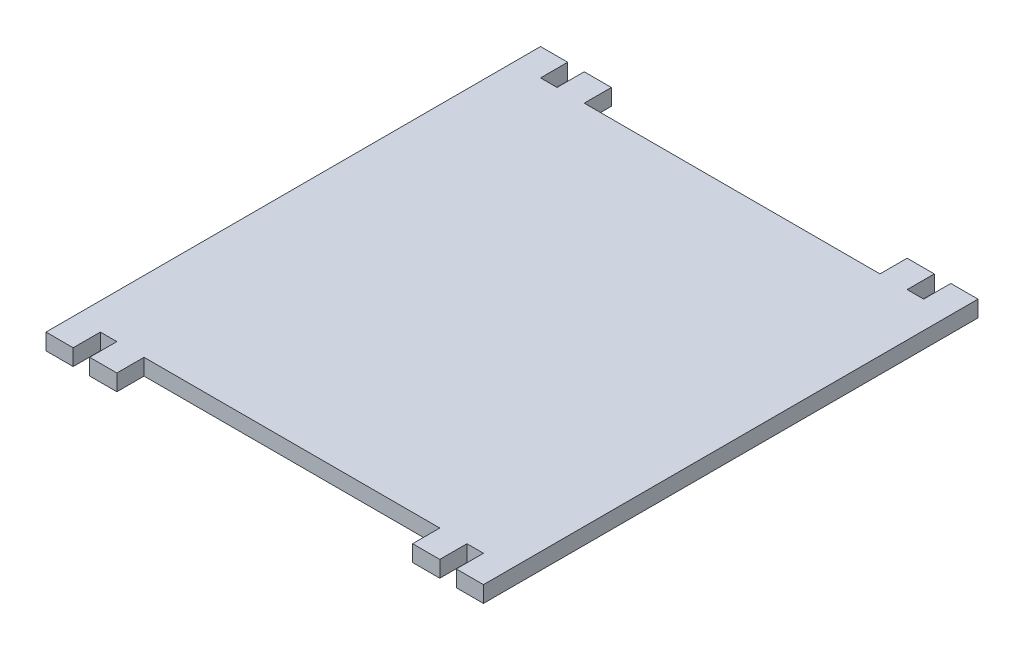
ISO-10303-21;
HEADER;
FILE_DESCRIPTION(('STEP AP214'),'2;1');
FILE_NAME('part.step','',(''),(''),'','','');
FILE_SCHEMA(('AUTOMOTIVE_DESIGN { 1 0 10303 214 1 1 1 1 }'));
ENDSEC;
DATA;
#1=APPLICATION_CONTEXT('core data for automotive mechanical design processes');
#2=APPLICATION_PROTOCOL_DEFINITION('international standard','automotive_design',2000,#1);
#3=PRODUCT_CONTEXT('',#1,'mechanical');
#4=PRODUCT('Part','Part','',(#3));
#5=PRODUCT_RELATED_PRODUCT_CATEGORY('part','',(#4));
#6=PRODUCT_DEFINITION_FORMATION('','',#4);
#7=PRODUCT_DEFINITION_CONTEXT('part definition',#1,'design');
#8=PRODUCT_DEFINITION('design','',#6,#7);
#9=PRODUCT_DEFINITION_SHAPE('','',#8);
#10=(LENGTH_UNIT() NAMED_UNIT(*) SI_UNIT(.MILLI.,.METRE.));
#11=(NAMED_UNIT(*) PLANE_ANGLE_UNIT() SI_UNIT($,.RADIAN.));
#12=(NAMED_UNIT(*) SI_UNIT($,.STERADIAN.) SOLID_ANGLE_UNIT());
#13=UNCERTAINTY_MEASURE_WITH_UNIT(LENGTH_MEASURE(1.E-05),#10,'distance_accuracy_value','');
#14=(GEOMETRIC_REPRESENTATION_CONTEXT(3) GLOBAL_UNCERTAINTY_ASSIGNED_CONTEXT((#13)) GLOBAL_UNIT_ASSIGNED_CONTEXT((#10,
#11,#12)) REPRESENTATION_CONTEXT('',''));
#15=CARTESIAN_POINT('',(0.,0.,0.));
#16=DIRECTION('',(0.,0.,1.));
#17=DIRECTION('',(1.,0.,0.));
#18=AXIS2_PLACEMENT_3D('',#15,#16,#17);
#19=CARTESIAN_POINT('',(0.,3.,0.));
#20=DIRECTION('',(0.,0.,1.));
#21=DIRECTION('',(1.,0.,0.));
#22=AXIS2_PLACEMENT_3D('',#19,#20,#21);
#23=PLANE('',#22);
#24=DIRECTION('',(0.,1.,0.));
#25=VECTOR('',#24,1.);
#26=CARTESIAN_POINT('',(62.46,3.,0.));
#27=LINE('',#26,#25);
#28=CARTESIAN_POINT('',(62.46,0.,0.));
#29=VERTEX_POINT('',#28);
#30=CARTESIAN_POINT('',(62.46,3.,0.));
#31=VERTEX_POINT('',#30);
#32=EDGE_CURVE('E295',#29,#31,#27,.T.);
#33=ORIENTED_EDGE('',*,*,#32,.F.);
#34=DIRECTION('',(-1.,0.,0.));
#35=VECTOR('',#34,1.);
#36=CARTESIAN_POINT('',(0.,0.,0.));
#37=LINE('',#36,#35);
#38=CARTESIAN_POINT('',(8.04000000000001,0.,0.));
#39=VERTEX_POINT('',#38);
#40=EDGE_CURVE('E422',#29,#39,#37,.T.);
#41=ORIENTED_EDGE('',*,*,#40,.T.);
#42=DIRECTION('',(0.,-1.,0.));
#43=VECTOR('',#42,1.);
#44=CARTESIAN_POINT('',(8.04000000000001,3.,0.));
#45=LINE('',#44,#43);
#46=CARTESIAN_POINT('',(8.04000000000001,3.,0.));
#47=VERTEX_POINT('',#46);
#48=EDGE_CURVE('E330',#47,#39,#45,.T.);
#49=ORIENTED_EDGE('',*,*,#48,.F.);
#50=DIRECTION('',(-1.,0.,0.));
#51=VECTOR('',#50,1.);
#52=CARTESIAN_POINT('',(0.,3.,0.));
#53=LINE('',#52,#51);
#54=EDGE_CURVE('E51',#31,#47,#53,.T.);
#55=ORIENTED_EDGE('',*,*,#54,.F.);
#56=EDGE_LOOP('',(#33,#41,#49,#55));
#57=FACE_BOUND('',#56,.T.);
#58=ADVANCED_FACE('F36',(#57),#23,.F.);
#59=DIRECTION('',(0.,-1.,0.));
#60=VECTOR('',#59,1.);
#61=CARTESIAN_POINT('',(67.46,3.,0.));
#62=LINE('',#61,#60);
#63=CARTESIAN_POINT('',(67.46,3.,0.));
#64=VERTEX_POINT('',#63);
#65=CARTESIAN_POINT('',(67.46,0.,0.));
#66=VERTEX_POINT('',#65);
#67=EDGE_CURVE('E59',#64,#66,#62,.T.);
#68=ORIENTED_EDGE('',*,*,#67,.F.);
#69=CARTESIAN_POINT('',(70.5,3.,0.));
#70=VERTEX_POINT('',#69);
#71=EDGE_CURVE('E413',#70,#64,#53,.T.);
#72=ORIENTED_EDGE('',*,*,#71,.F.);
#73=DIRECTION('',(0.,-1.,0.));
#74=VECTOR('',#73,1.);
#75=CARTESIAN_POINT('',(70.5,3.,0.));
#76=LINE('',#75,#74);
#77=CARTESIAN_POINT('',(70.5,0.,0.));
#78=VERTEX_POINT('',#77);
#79=EDGE_CURVE('E425',#70,#78,#76,.T.);
#80=ORIENTED_EDGE('',*,*,#79,.T.);
#81=EDGE_CURVE('E420',#78,#66,#37,.T.);
#82=ORIENTED_EDGE('',*,*,#81,.T.);
#83=EDGE_LOOP('',(#68,#72,#80,#82));
#84=FACE_BOUND('',#83,.T.);
#85=ADVANCED_FACE('F428',(#84),#23,.F.);
#86=DIRECTION('',(0.,1.,0.));
#87=VECTOR('',#86,1.);
#88=CARTESIAN_POINT('',(3.04000000000001,3.,0.));
#89=LINE('',#88,#87);
#90=CARTESIAN_POINT('',(3.04000000000001,0.,0.));
#91=VERTEX_POINT('',#90);
#92=CARTESIAN_POINT('',(3.04000000000001,3.,0.));
#93=VERTEX_POINT('',#92);
#94=EDGE_CURVE('E325',#91,#93,#89,.T.);
#95=ORIENTED_EDGE('',*,*,#94,.F.);
#96=CARTESIAN_POINT('',(0.,0.,0.));
#97=VERTEX_POINT('',#96);
#98=EDGE_CURVE('E418',#91,#97,#37,.T.);
#99=ORIENTED_EDGE('',*,*,#98,.T.);
#100=DIRECTION('',(0.,-1.,0.));
#101=VECTOR('',#100,1.);
#102=CARTESIAN_POINT('',(0.,3.,0.));
#103=LINE('',#102,#101);
#104=CARTESIAN_POINT('',(0.,3.,0.));
#105=VERTEX_POINT('',#104);
#106=EDGE_CURVE('E415',#105,#97,#103,.T.);
#107=ORIENTED_EDGE('',*,*,#106,.F.);
#108=EDGE_CURVE('E410',#93,#105,#53,.T.);
#109=ORIENTED_EDGE('',*,*,#108,.F.);
#110=EDGE_LOOP('',(#95,#99,#107,#109));
#111=FACE_BOUND('',#110,.T.);
#112=ADVANCED_FACE('F527',(#111),#23,.F.);
#113=CARTESIAN_POINT('',(0.,3.,81.));
#114=DIRECTION('',(0.,0.,-1.));
#115=DIRECTION('',(-1.,0.,0.));
#116=AXIS2_PLACEMENT_3D('',#113,#114,#115);
#117=PLANE('',#116);
#118=DIRECTION('',(0.,1.,0.));
#119=VECTOR('',#118,1.);
#120=CARTESIAN_POINT('',(67.46,3.,81.));
#121=LINE('',#120,#119);
#122=CARTESIAN_POINT('',(67.46,0.,81.));
#123=VERTEX_POINT('',#122);
#124=CARTESIAN_POINT('',(67.46,3.,81.));
#125=VERTEX_POINT('',#124);
#126=EDGE_CURVE('E352',#123,#125,#121,.T.);
#127=ORIENTED_EDGE('',*,*,#126,.F.);
#128=DIRECTION('',(1.,0.,0.));
#129=VECTOR('',#128,1.);
#130=CARTESIAN_POINT('',(0.,0.,81.));
#131=LINE('',#130,#129);
#132=CARTESIAN_POINT('',(70.5,0.,81.));
#133=VERTEX_POINT('',#132);
#134=EDGE_CURVE('E406',#123,#133,#131,.T.);
#135=ORIENTED_EDGE('',*,*,#134,.T.);
#136=DIRECTION('',(0.,-1.,0.));
#137=VECTOR('',#136,1.);
#138=CARTESIAN_POINT('',(70.5,3.,81.));
#139=LINE('',#138,#137);
#140=CARTESIAN_POINT('',(70.5,3.,81.));
#141=VERTEX_POINT('',#140);
#142=EDGE_CURVE('E44',#141,#133,#139,.T.);
#143=ORIENTED_EDGE('',*,*,#142,.F.);
#144=DIRECTION('',(1.,0.,0.));
#145=VECTOR('',#144,1.);
#146=CARTESIAN_POINT('',(0.,3.,81.));
#147=LINE('',#146,#145);
#148=EDGE_CURVE('E412',#125,#141,#147,.T.);
#149=ORIENTED_EDGE('',*,*,#148,.F.);
#150=EDGE_LOOP('',(#127,#135,#143,#149));
#151=FACE_BOUND('',#150,.T.);
#152=ADVANCED_FACE('F449',(#151),#117,.F.);
#153=DIRECTION('',(0.,-1.,0.));
#154=VECTOR('',#153,1.);
#155=CARTESIAN_POINT('',(62.46,3.,81.));
#156=LINE('',#155,#154);
#157=CARTESIAN_POINT('',(62.46,3.,81.));
#158=VERTEX_POINT('',#157);
#159=CARTESIAN_POINT('',(62.46,0.,81.));
#160=VERTEX_POINT('',#159);
#161=EDGE_CURVE('E357',#158,#160,#156,.T.);
#162=ORIENTED_EDGE('',*,*,#161,.F.);
#163=CARTESIAN_POINT('',(8.04000000000001,3.,81.));
#164=VERTEX_POINT('',#163);
#165=EDGE_CURVE('E411',#164,#158,#147,.T.);
#166=ORIENTED_EDGE('',*,*,#165,.F.);
#167=DIRECTION('',(0.,1.,0.));
#168=VECTOR('',#167,1.);
#169=CARTESIAN_POINT('',(8.04000000000001,3.,81.));
#170=LINE('',#169,#168);
#171=CARTESIAN_POINT('',(8.04000000000001,0.,81.));
#172=VERTEX_POINT('',#171);
#173=EDGE_CURVE('E384',#172,#164,#170,.T.);
#174=ORIENTED_EDGE('',*,*,#173,.F.);
#175=EDGE_CURVE('E419',#172,#160,#131,.T.);
#176=ORIENTED_EDGE('',*,*,#175,.T.);
#177=EDGE_LOOP('',(#162,#166,#174,#176));
#178=FACE_BOUND('',#177,.T.);
#179=ADVANCED_FACE('F453',(#178),#117,.F.);
#180=DIRECTION('',(0.,-1.,0.));
#181=VECTOR('',#180,1.);
#182=CARTESIAN_POINT('',(3.04000000000001,3.,81.));
#183=LINE('',#182,#181);
#184=CARTESIAN_POINT('',(3.04000000000001,3.,81.));
#185=VERTEX_POINT('',#184);
#186=CARTESIAN_POINT('',(3.04000000000001,0.,81.));
#187=VERTEX_POINT('',#186);
#188=EDGE_CURVE('E379',#185,#187,#183,.T.);
#189=ORIENTED_EDGE('',*,*,#188,.F.);
#190=CARTESIAN_POINT('',(0.,3.,81.));
#191=VERTEX_POINT('',#190);
#192=EDGE_CURVE('E407',#191,#185,#147,.T.);
#193=ORIENTED_EDGE('',*,*,#192,.F.);
#194=DIRECTION('',(0.,-1.,0.));
#195=VECTOR('',#194,1.);
#196=CARTESIAN_POINT('',(0.,3.,81.));
#197=LINE('',#196,#195);
#198=CARTESIAN_POINT('',(0.,0.,81.));
#199=VERTEX_POINT('',#198);
#200=EDGE_CURVE('E11',#191,#199,#197,.T.);
#201=ORIENTED_EDGE('',*,*,#200,.T.);
#202=EDGE_CURVE('E416',#199,#187,#131,.T.);
#203=ORIENTED_EDGE('',*,*,#202,.T.);
#204=EDGE_LOOP('',(#189,#193,#201,#203));
#205=FACE_BOUND('',#204,.T.);
#206=ADVANCED_FACE('F38',(#205),#117,.F.);
#207=CARTESIAN_POINT('',(0.,3.,0.));
#208=DIRECTION('',(0.,1.,0.));
#209=DIRECTION('',(0.,0.,1.));
#210=AXIS2_PLACEMENT_3D('',#207,#208,#209);
#211=PLANE('',#210);
#212=ORIENTED_EDGE('',*,*,#108,.T.);
#213=DIRECTION('',(0.,0.,1.));
#214=VECTOR('',#213,1.);
#215=CARTESIAN_POINT('',(0.,3.,0.));
#216=LINE('',#215,#214);
#217=CARTESIAN_POINT('',(0.,3.,-5.));
#218=VERTEX_POINT('',#217);
#219=EDGE_CURVE('E272',#218,#105,#216,.T.);
#220=ORIENTED_EDGE('',*,*,#219,.F.);
#221=DIRECTION('',(-1.,0.,0.));
#222=VECTOR('',#221,1.);
#223=CARTESIAN_POINT('',(0.,3.,-5.));
#224=LINE('',#223,#222);
#225=CARTESIAN_POINT('',(-5.,3.,-5.));
#226=VERTEX_POINT('',#225);
#227=EDGE_CURVE('E263',#218,#226,#224,.T.);
#228=ORIENTED_EDGE('',*,*,#227,.T.);
#229=DIRECTION('',(0.,0.,1.));
#230=VECTOR('',#229,1.);
#231=CARTESIAN_POINT('',(-5.,3.,0.));
#232=LINE('',#231,#230);
#233=CARTESIAN_POINT('',(-4.99999999999999,3.,86.));
#234=VERTEX_POINT('',#233);
#235=EDGE_CURVE('E284',#226,#234,#232,.T.);
#236=ORIENTED_EDGE('',*,*,#235,.T.);
#237=DIRECTION('',(-1.,0.,0.));
#238=VECTOR('',#237,1.);
#239=CARTESIAN_POINT('',(0.,3.,86.));
#240=LINE('',#239,#238);
#241=CARTESIAN_POINT('',(0.,3.,86.));
#242=VERTEX_POINT('',#241);
#243=EDGE_CURVE('E287',#242,#234,#240,.T.);
#244=ORIENTED_EDGE('',*,*,#243,.F.);
#245=EDGE_CURVE('E290',#191,#242,#216,.T.);
#246=ORIENTED_EDGE('',*,*,#245,.F.);
#247=ORIENTED_EDGE('',*,*,#192,.T.);
#248=DIRECTION('',(0.,0.,-1.));
#249=VECTOR('',#248,1.);
#250=CARTESIAN_POINT('',(3.04000000000001,3.,86.));
#251=LINE('',#250,#249);
#252=CARTESIAN_POINT('',(3.04000000000001,3.,86.));
#253=VERTEX_POINT('',#252);
#254=EDGE_CURVE('E390',#253,#185,#251,.T.);
#255=ORIENTED_EDGE('',*,*,#254,.F.);
#256=DIRECTION('',(-1.,0.,0.));
#257=VECTOR('',#256,1.);
#258=CARTESIAN_POINT('',(3.04000000000001,3.,86.));
#259=LINE('',#258,#257);
#260=CARTESIAN_POINT('',(8.04000000000001,3.,86.));
#261=VERTEX_POINT('',#260);
#262=EDGE_CURVE('E388',#261,#253,#259,.T.);
#263=ORIENTED_EDGE('',*,*,#262,.F.);
#264=DIRECTION('',(0.,0.,-1.));
#265=VECTOR('',#264,1.);
#266=CARTESIAN_POINT('',(8.04000000000001,3.,86.));
#267=LINE('',#266,#265);
#268=EDGE_CURVE('E397',#261,#164,#267,.T.);
#269=ORIENTED_EDGE('',*,*,#268,.T.);
#270=ORIENTED_EDGE('',*,*,#165,.T.);
#271=DIRECTION('',(0.,0.,-1.));
#272=VECTOR('',#271,1.);
#273=CARTESIAN_POINT('',(62.46,3.,86.));
#274=LINE('',#273,#272);
#275=CARTESIAN_POINT('',(62.46,3.,86.));
#276=VERTEX_POINT('',#275);
#277=EDGE_CURVE('E373',#276,#158,#274,.T.);
#278=ORIENTED_EDGE('',*,*,#277,.F.);
#279=DIRECTION('',(-1.,0.,0.));
#280=VECTOR('',#279,1.);
#281=CARTESIAN_POINT('',(67.46,3.,86.));
#282=LINE('',#281,#280);
#283=CARTESIAN_POINT('',(67.46,3.,86.));
#284=VERTEX_POINT('',#283);
#285=EDGE_CURVE('E356',#284,#276,#282,.T.);
#286=ORIENTED_EDGE('',*,*,#285,.F.);
#287=DIRECTION('',(0.,0.,-1.));
#288=VECTOR('',#287,1.);
#289=CARTESIAN_POINT('',(67.46,3.,86.));
#290=LINE('',#289,#288);
#291=EDGE_CURVE('E376',#284,#125,#290,.T.);
#292=ORIENTED_EDGE('',*,*,#291,.T.);
#293=ORIENTED_EDGE('',*,*,#148,.T.);
#294=DIRECTION('',(0.,0.,-1.));
#295=VECTOR('',#294,1.);
#296=CARTESIAN_POINT('',(70.5,3.,0.));
#297=LINE('',#296,#295);
#298=CARTESIAN_POINT('',(70.5,3.,86.));
#299=VERTEX_POINT('',#298);
#300=EDGE_CURVE('E253',#299,#141,#297,.T.);
#301=ORIENTED_EDGE('',*,*,#300,.F.);
#302=DIRECTION('',(-1.,0.,0.));
#303=VECTOR('',#302,1.);
#304=CARTESIAN_POINT('',(-2.38697950294407E-13,3.,85.9999999999998));
#305=LINE('',#304,#303);
#306=CARTESIAN_POINT('',(75.5,3.,86.));
#307=VERTEX_POINT('',#306);
#308=EDGE_CURVE('E237',#307,#299,#305,.T.);
#309=ORIENTED_EDGE('',*,*,#308,.F.);
#310=DIRECTION('',(0.,0.,1.));
#311=VECTOR('',#310,1.);
#312=CARTESIAN_POINT('',(75.5,3.,0.));
#313=LINE('',#312,#311);
#314=CARTESIAN_POINT('',(75.5,3.,-5.));
#315=VERTEX_POINT('',#314);
#316=EDGE_CURVE('E257',#315,#307,#313,.T.);
#317=ORIENTED_EDGE('',*,*,#316,.F.);
#318=DIRECTION('',(1.,0.,0.));
#319=VECTOR('',#318,1.);
#320=CARTESIAN_POINT('',(0.,3.,-5.00000000000001));
#321=LINE('',#320,#319);
#322=CARTESIAN_POINT('',(70.5,3.,-5.));
#323=VERTEX_POINT('',#322);
#324=EDGE_CURVE('E249',#323,#315,#321,.T.);
#325=ORIENTED_EDGE('',*,*,#324,.F.);
#326=EDGE_CURVE('E255',#70,#323,#297,.T.);
#327=ORIENTED_EDGE('',*,*,#326,.F.);
#328=ORIENTED_EDGE('',*,*,#71,.T.);
#329=DIRECTION('',(0.,0.,1.));
#330=VECTOR('',#329,1.);
#331=CARTESIAN_POINT('',(67.46,3.,-5.));
#332=LINE('',#331,#330);
#333=CARTESIAN_POINT('',(67.46,3.,-5.));
#334=VERTEX_POINT('',#333);
#335=EDGE_CURVE('E320',#334,#64,#332,.T.);
#336=ORIENTED_EDGE('',*,*,#335,.F.);
#337=DIRECTION('',(1.,0.,0.));
#338=VECTOR('',#337,1.);
#339=CARTESIAN_POINT('',(62.46,3.,-5.));
#340=LINE('',#339,#338);
#341=CARTESIAN_POINT('',(62.46,3.,-5.));
#342=VERTEX_POINT('',#341);
#343=EDGE_CURVE('E305',#342,#334,#340,.T.);
#344=ORIENTED_EDGE('',*,*,#343,.F.);
#345=DIRECTION('',(0.,0.,1.));
#346=VECTOR('',#345,1.);
#347=CARTESIAN_POINT('',(62.46,3.,-5.));
#348=LINE('',#347,#346);
#349=EDGE_CURVE('E323',#342,#31,#348,.T.);
#350=ORIENTED_EDGE('',*,*,#349,.T.);
#351=ORIENTED_EDGE('',*,*,#54,.T.);
#352=DIRECTION('',(0.,0.,1.));
#353=VECTOR('',#352,1.);
#354=CARTESIAN_POINT('',(8.04000000000001,3.,-5.));
#355=LINE('',#354,#353);
#356=CARTESIAN_POINT('',(8.04000000000001,3.,-5.));
#357=VERTEX_POINT('',#356);
#358=EDGE_CURVE('E346',#357,#47,#355,.T.);
#359=ORIENTED_EDGE('',*,*,#358,.F.);
#360=DIRECTION('',(1.,0.,0.));
#361=VECTOR('',#360,1.);
#362=CARTESIAN_POINT('',(3.04000000000001,3.,-5.));
#363=LINE('',#362,#361);
#364=CARTESIAN_POINT('',(3.04000000000001,3.,-5.));
#365=VERTEX_POINT('',#364);
#366=EDGE_CURVE('E329',#365,#357,#363,.T.);
#367=ORIENTED_EDGE('',*,*,#366,.F.);
#368=DIRECTION('',(0.,0.,1.));
#369=VECTOR('',#368,1.);
#370=CARTESIAN_POINT('',(3.04000000000001,3.,-5.));
#371=LINE('',#370,#369);
#372=EDGE_CURVE('E349',#365,#93,#371,.T.);
#373=ORIENTED_EDGE('',*,*,#372,.T.);
#374=EDGE_LOOP('',(#212,#220,#228,#236,#244,#246,#247,#255,#263,#269,#270,#278,#286,#292,#293,
#301,#309,#317,#325,#327,#328,#336,#344,#350,#351,#359,#367,#373));
#375=FACE_BOUND('',#374,.T.);
#376=ADVANCED_FACE('F445',(#375),#211,.T.);
#377=CARTESIAN_POINT('',(0.,0.,0.));
#378=DIRECTION('',(0.,1.,0.));
#379=DIRECTION('',(0.,0.,1.));
#380=AXIS2_PLACEMENT_3D('',#377,#378,#379);
#381=PLANE('',#380);
#382=ORIENTED_EDGE('',*,*,#202,.F.);
#383=DIRECTION('',(0.,0.,1.));
#384=VECTOR('',#383,1.);
#385=CARTESIAN_POINT('',(0.,0.,0.));
#386=LINE('',#385,#384);
#387=CARTESIAN_POINT('',(0.,0.,86.));
#388=VERTEX_POINT('',#387);
#389=EDGE_CURVE('E277',#199,#388,#386,.T.);
#390=ORIENTED_EDGE('',*,*,#389,.T.);
#391=DIRECTION('',(-1.,0.,0.));
#392=VECTOR('',#391,1.);
#393=CARTESIAN_POINT('',(0.,0.,86.));
#394=LINE('',#393,#392);
#395=CARTESIAN_POINT('',(-4.99999999999999,0.,86.));
#396=VERTEX_POINT('',#395);
#397=EDGE_CURVE('E275',#388,#396,#394,.T.);
#398=ORIENTED_EDGE('',*,*,#397,.T.);
#399=DIRECTION('',(0.,0.,1.));
#400=VECTOR('',#399,1.);
#401=CARTESIAN_POINT('',(-5.,0.,0.));
#402=LINE('',#401,#400);
#403=CARTESIAN_POINT('',(-5.,0.,-5.));
#404=VERTEX_POINT('',#403);
#405=EDGE_CURVE('E271',#404,#396,#402,.T.);
#406=ORIENTED_EDGE('',*,*,#405,.F.);
#407=DIRECTION('',(-1.,0.,0.));
#408=VECTOR('',#407,1.);
#409=CARTESIAN_POINT('',(0.,0.,-5.));
#410=LINE('',#409,#408);
#411=CARTESIAN_POINT('',(0.,0.,-5.));
#412=VERTEX_POINT('',#411);
#413=EDGE_CURVE('E268',#412,#404,#410,.T.);
#414=ORIENTED_EDGE('',*,*,#413,.F.);
#415=EDGE_CURVE('E278',#412,#97,#386,.T.);
#416=ORIENTED_EDGE('',*,*,#415,.T.);
#417=ORIENTED_EDGE('',*,*,#98,.F.);
#418=DIRECTION('',(0.,0.,1.));
#419=VECTOR('',#418,1.);
#420=CARTESIAN_POINT('',(3.04000000000001,0.,-5.));
#421=LINE('',#420,#419);
#422=CARTESIAN_POINT('',(3.04000000000001,0.,-5.));
#423=VERTEX_POINT('',#422);
#424=EDGE_CURVE('E336',#423,#91,#421,.T.);
#425=ORIENTED_EDGE('',*,*,#424,.F.);
#426=DIRECTION('',(-1.,0.,0.));
#427=VECTOR('',#426,1.);
#428=CARTESIAN_POINT('',(3.04000000000001,0.,-5.));
#429=LINE('',#428,#427);
#430=CARTESIAN_POINT('',(8.04000000000001,0.,-5.));
#431=VERTEX_POINT('',#430);
#432=EDGE_CURVE('E334',#431,#423,#429,.T.);
#433=ORIENTED_EDGE('',*,*,#432,.F.);
#434=DIRECTION('',(0.,0.,1.));
#435=VECTOR('',#434,1.);
#436=CARTESIAN_POINT('',(8.04000000000001,0.,-5.));
#437=LINE('',#436,#435);
#438=EDGE_CURVE('E343',#431,#39,#437,.T.);
#439=ORIENTED_EDGE('',*,*,#438,.T.);
#440=ORIENTED_EDGE('',*,*,#40,.F.);
#441=DIRECTION('',(0.,0.,1.));
#442=VECTOR('',#441,1.);
#443=CARTESIAN_POINT('',(62.46,0.,-5.));
#444=LINE('',#443,#442);
#445=CARTESIAN_POINT('',(62.46,0.,-5.));
#446=VERTEX_POINT('',#445);
#447=EDGE_CURVE('E311',#446,#29,#444,.T.);
#448=ORIENTED_EDGE('',*,*,#447,.F.);
#449=DIRECTION('',(-1.,0.,0.));
#450=VECTOR('',#449,1.);
#451=CARTESIAN_POINT('',(62.46,0.,-5.));
#452=LINE('',#451,#450);
#453=CARTESIAN_POINT('',(67.46,0.,-5.));
#454=VERTEX_POINT('',#453);
#455=EDGE_CURVE('E309',#454,#446,#452,.T.);
#456=ORIENTED_EDGE('',*,*,#455,.F.);
#457=DIRECTION('',(0.,0.,1.));
#458=VECTOR('',#457,1.);
#459=CARTESIAN_POINT('',(67.46,0.,-5.));
#460=LINE('',#459,#458);
#461=EDGE_CURVE('E317',#454,#66,#460,.T.);
#462=ORIENTED_EDGE('',*,*,#461,.T.);
#463=ORIENTED_EDGE('',*,*,#81,.F.);
#464=DIRECTION('',(0.,0.,-1.));
#465=VECTOR('',#464,1.);
#466=CARTESIAN_POINT('',(70.5,0.,0.));
#467=LINE('',#466,#465);
#468=CARTESIAN_POINT('',(70.5,0.,-5.));
#469=VERTEX_POINT('',#468);
#470=EDGE_CURVE('E247',#78,#469,#467,.T.);
#471=ORIENTED_EDGE('',*,*,#470,.T.);
#472=DIRECTION('',(1.,0.,0.));
#473=VECTOR('',#472,1.);
#474=CARTESIAN_POINT('',(0.,0.,-5.00000000000001));
#475=LINE('',#474,#473);
#476=CARTESIAN_POINT('',(75.5,0.,-5.));
#477=VERTEX_POINT('',#476);
#478=EDGE_CURVE('E242',#469,#477,#475,.T.);
#479=ORIENTED_EDGE('',*,*,#478,.T.);
#480=DIRECTION('',(0.,0.,1.));
#481=VECTOR('',#480,1.);
#482=CARTESIAN_POINT('',(75.5,0.,0.));
#483=LINE('',#482,#481);
#484=CARTESIAN_POINT('',(75.5,0.,86.));
#485=VERTEX_POINT('',#484);
#486=EDGE_CURVE('E228',#477,#485,#483,.T.);
#487=ORIENTED_EDGE('',*,*,#486,.T.);
#488=DIRECTION('',(-1.,0.,0.));
#489=VECTOR('',#488,1.);
#490=CARTESIAN_POINT('',(-2.38697950294407E-13,0.,85.9999999999998));
#491=LINE('',#490,#489);
#492=CARTESIAN_POINT('',(70.5,0.,86.));
#493=VERTEX_POINT('',#492);
#494=EDGE_CURVE('E222',#485,#493,#491,.T.);
#495=ORIENTED_EDGE('',*,*,#494,.T.);
#496=EDGE_CURVE('E226',#493,#133,#467,.T.);
#497=ORIENTED_EDGE('',*,*,#496,.T.);
#498=ORIENTED_EDGE('',*,*,#134,.F.);
#499=DIRECTION('',(0.,0.,-1.));
#500=VECTOR('',#499,1.);
#501=CARTESIAN_POINT('',(67.46,0.,86.));
#502=LINE('',#501,#500);
#503=CARTESIAN_POINT('',(67.46,0.,86.));
#504=VERTEX_POINT('',#503);
#505=EDGE_CURVE('E363',#504,#123,#502,.T.);
#506=ORIENTED_EDGE('',*,*,#505,.F.);
#507=DIRECTION('',(1.,0.,0.));
#508=VECTOR('',#507,1.);
#509=CARTESIAN_POINT('',(67.46,0.,86.));
#510=LINE('',#509,#508);
#511=CARTESIAN_POINT('',(62.46,0.,86.));
#512=VERTEX_POINT('',#511);
#513=EDGE_CURVE('E361',#512,#504,#510,.T.);
#514=ORIENTED_EDGE('',*,*,#513,.F.);
#515=DIRECTION('',(0.,0.,-1.));
#516=VECTOR('',#515,1.);
#517=CARTESIAN_POINT('',(62.46,0.,86.));
#518=LINE('',#517,#516);
#519=EDGE_CURVE('E370',#512,#160,#518,.T.);
#520=ORIENTED_EDGE('',*,*,#519,.T.);
#521=ORIENTED_EDGE('',*,*,#175,.F.);
#522=DIRECTION('',(0.,0.,-1.));
#523=VECTOR('',#522,1.);
#524=CARTESIAN_POINT('',(8.04000000000001,0.,86.));
#525=LINE('',#524,#523);
#526=CARTESIAN_POINT('',(8.04000000000001,0.,86.));
#527=VERTEX_POINT('',#526);
#528=EDGE_CURVE('E400',#527,#172,#525,.T.);
#529=ORIENTED_EDGE('',*,*,#528,.F.);
#530=DIRECTION('',(1.,0.,0.));
#531=VECTOR('',#530,1.);
#532=CARTESIAN_POINT('',(3.04000000000001,0.,86.));
#533=LINE('',#532,#531);
#534=CARTESIAN_POINT('',(3.04000000000001,0.,86.));
#535=VERTEX_POINT('',#534);
#536=EDGE_CURVE('E383',#535,#527,#533,.T.);
#537=ORIENTED_EDGE('',*,*,#536,.F.);
#538=DIRECTION('',(0.,0.,-1.));
#539=VECTOR('',#538,1.);
#540=CARTESIAN_POINT('',(3.04000000000001,0.,86.));
#541=LINE('',#540,#539);
#542=EDGE_CURVE('E403',#535,#187,#541,.T.);
#543=ORIENTED_EDGE('',*,*,#542,.T.);
#544=EDGE_LOOP('',(#382,#390,#398,#406,#414,#416,#417,#425,#433,#439,#440,#448,#456,#462,#463,
#471,#479,#487,#495,#497,#498,#506,#514,#520,#521,#529,#537,#543));
#545=FACE_BOUND('',#544,.T.);
#546=ADVANCED_FACE('F224',(#545),#381,.F.);
#547=CARTESIAN_POINT('',(3.04000000000001,3.,86.));
#548=DIRECTION('',(1.,0.,0.));
#549=DIRECTION('',(0.,1.,0.));
#550=AXIS2_PLACEMENT_3D('',#547,#548,#549);
#551=PLANE('',#550);
#552=ORIENTED_EDGE('',*,*,#188,.T.);
#553=ORIENTED_EDGE('',*,*,#542,.F.);
#554=DIRECTION('',(0.,-1.,0.));
#555=VECTOR('',#554,1.);
#556=CARTESIAN_POINT('',(3.04000000000001,3.,86.));
#557=LINE('',#556,#555);
#558=EDGE_CURVE('E380',#253,#535,#557,.T.);
#559=ORIENTED_EDGE('',*,*,#558,.F.);
#560=ORIENTED_EDGE('',*,*,#254,.T.);
#561=EDGE_LOOP('',(#552,#553,#559,#560));
#562=FACE_BOUND('',#561,.T.);
#563=ADVANCED_FACE('F476',(#562),#551,.F.);
#564=CARTESIAN_POINT('',(8.04000000000001,3.,86.));
#565=DIRECTION('',(-1.,0.,0.));
#566=DIRECTION('',(0.,0.,1.));
#567=AXIS2_PLACEMENT_3D('',#564,#565,#566);
#568=PLANE('',#567);
#569=ORIENTED_EDGE('',*,*,#173,.T.);
#570=ORIENTED_EDGE('',*,*,#268,.F.);
#571=DIRECTION('',(0.,1.,0.));
#572=VECTOR('',#571,1.);
#573=CARTESIAN_POINT('',(8.04000000000001,3.,86.));
#574=LINE('',#573,#572);
#575=EDGE_CURVE('E386',#527,#261,#574,.T.);
#576=ORIENTED_EDGE('',*,*,#575,.F.);
#577=ORIENTED_EDGE('',*,*,#528,.T.);
#578=EDGE_LOOP('',(#569,#570,#576,#577));
#579=FACE_BOUND('',#578,.T.);
#580=ADVANCED_FACE('F468',(#579),#568,.F.);
#581=CARTESIAN_POINT('',(0.,0.,86.));
#582=DIRECTION('',(0.,0.,1.));
#583=DIRECTION('',(1.,0.,0.));
#584=AXIS2_PLACEMENT_3D('',#581,#582,#583);
#585=PLANE('',#584);
#586=ORIENTED_EDGE('',*,*,#558,.T.);
#587=ORIENTED_EDGE('',*,*,#536,.T.);
#588=ORIENTED_EDGE('',*,*,#575,.T.);
#589=ORIENTED_EDGE('',*,*,#262,.T.);
#590=EDGE_LOOP('',(#586,#587,#588,#589));
#591=FACE_BOUND('',#590,.T.);
#592=ADVANCED_FACE('F473',(#591),#585,.T.);
#593=CARTESIAN_POINT('',(67.46,3.,86.));
#594=DIRECTION('',(-1.,0.,0.));
#595=DIRECTION('',(0.,0.,1.));
#596=AXIS2_PLACEMENT_3D('',#593,#594,#595);
#597=PLANE('',#596);
#598=ORIENTED_EDGE('',*,*,#126,.T.);
#599=ORIENTED_EDGE('',*,*,#291,.F.);
#600=DIRECTION('',(0.,1.,0.));
#601=VECTOR('',#600,1.);
#602=CARTESIAN_POINT('',(67.46,3.,86.));
#603=LINE('',#602,#601);
#604=EDGE_CURVE('E353',#504,#284,#603,.T.);
#605=ORIENTED_EDGE('',*,*,#604,.F.);
#606=ORIENTED_EDGE('',*,*,#505,.T.);
#607=EDGE_LOOP('',(#598,#599,#605,#606));
#608=FACE_BOUND('',#607,.T.);
#609=ADVANCED_FACE('F695',(#608),#597,.F.);
#610=CARTESIAN_POINT('',(62.46,3.,86.));
#611=DIRECTION('',(1.,0.,0.));
#612=DIRECTION('',(0.,0.,-1.));
#613=AXIS2_PLACEMENT_3D('',#610,#611,#612);
#614=PLANE('',#613);
#615=ORIENTED_EDGE('',*,*,#161,.T.);
#616=ORIENTED_EDGE('',*,*,#519,.F.);
#617=DIRECTION('',(0.,-1.,0.));
#618=VECTOR('',#617,1.);
#619=CARTESIAN_POINT('',(62.46,3.,86.));
#620=LINE('',#619,#618);
#621=EDGE_CURVE('E359',#276,#512,#620,.T.);
#622=ORIENTED_EDGE('',*,*,#621,.F.);
#623=ORIENTED_EDGE('',*,*,#277,.T.);
#624=EDGE_LOOP('',(#615,#616,#622,#623));
#625=FACE_BOUND('',#624,.T.);
#626=ADVANCED_FACE('F458',(#625),#614,.F.);
#627=CARTESIAN_POINT('',(0.,0.,86.));
#628=DIRECTION('',(0.,0.,-1.));
#629=DIRECTION('',(-1.,0.,0.));
#630=AXIS2_PLACEMENT_3D('',#627,#628,#629);
#631=PLANE('',#630);
#632=ORIENTED_EDGE('',*,*,#604,.T.);
#633=ORIENTED_EDGE('',*,*,#285,.T.);
#634=ORIENTED_EDGE('',*,*,#621,.T.);
#635=ORIENTED_EDGE('',*,*,#513,.T.);
#636=EDGE_LOOP('',(#632,#633,#634,#635));
#637=FACE_BOUND('',#636,.T.);
#638=ADVANCED_FACE('F464',(#637),#631,.F.);
#639=CARTESIAN_POINT('',(3.04000000000001,3.,-5.));
#640=DIRECTION('',(1.,0.,0.));
#641=DIRECTION('',(0.,0.,-1.));
#642=AXIS2_PLACEMENT_3D('',#639,#640,#641);
#643=PLANE('',#642);
#644=ORIENTED_EDGE('',*,*,#94,.T.);
#645=ORIENTED_EDGE('',*,*,#372,.F.);
#646=DIRECTION('',(0.,1.,0.));
#647=VECTOR('',#646,1.);
#648=CARTESIAN_POINT('',(3.04000000000001,3.,-5.));
#649=LINE('',#648,#647);
#650=EDGE_CURVE('E326',#423,#365,#649,.T.);
#651=ORIENTED_EDGE('',*,*,#650,.F.);
#652=ORIENTED_EDGE('',*,*,#424,.T.);
#653=EDGE_LOOP('',(#644,#645,#651,#652));
#654=FACE_BOUND('',#653,.T.);
#655=ADVANCED_FACE('F507',(#654),#643,.F.);
#656=CARTESIAN_POINT('',(8.04000000000001,3.,-5.));
#657=DIRECTION('',(-1.,0.,0.));
#658=DIRECTION('',(0.,0.,1.));
#659=AXIS2_PLACEMENT_3D('',#656,#657,#658);
#660=PLANE('',#659);
#661=ORIENTED_EDGE('',*,*,#48,.T.);
#662=ORIENTED_EDGE('',*,*,#438,.F.);
#663=DIRECTION('',(0.,-1.,0.));
#664=VECTOR('',#663,1.);
#665=CARTESIAN_POINT('',(8.04000000000001,3.,-5.));
#666=LINE('',#665,#664);
#667=EDGE_CURVE('E332',#357,#431,#666,.T.);
#668=ORIENTED_EDGE('',*,*,#667,.F.);
#669=ORIENTED_EDGE('',*,*,#358,.T.);
#670=EDGE_LOOP('',(#661,#662,#668,#669));
#671=FACE_BOUND('',#670,.T.);
#672=ADVANCED_FACE('F516',(#671),#660,.F.);
#673=CARTESIAN_POINT('',(0.,0.,-5.));
#674=DIRECTION('',(0.,0.,1.));
#675=DIRECTION('',(1.,0.,0.));
#676=AXIS2_PLACEMENT_3D('',#673,#674,#675);
#677=PLANE('',#676);
#678=ORIENTED_EDGE('',*,*,#650,.T.);
#679=ORIENTED_EDGE('',*,*,#366,.T.);
#680=ORIENTED_EDGE('',*,*,#667,.T.);
#681=ORIENTED_EDGE('',*,*,#432,.T.);
#682=EDGE_LOOP('',(#678,#679,#680,#681));
#683=FACE_BOUND('',#682,.T.);
#684=ADVANCED_FACE('F510',(#683),#677,.F.);
#685=CARTESIAN_POINT('',(62.46,3.,-5.));
#686=DIRECTION('',(1.,0.,0.));
#687=DIRECTION('',(0.,0.,-1.));
#688=AXIS2_PLACEMENT_3D('',#685,#686,#687);
#689=PLANE('',#688);
#690=ORIENTED_EDGE('',*,*,#32,.T.);
#691=ORIENTED_EDGE('',*,*,#349,.F.);
#692=DIRECTION('',(0.,1.,0.));
#693=VECTOR('',#692,1.);
#694=CARTESIAN_POINT('',(62.46,3.,-5.));
#695=LINE('',#694,#693);
#696=EDGE_CURVE('E302',#446,#342,#695,.T.);
#697=ORIENTED_EDGE('',*,*,#696,.F.);
#698=ORIENTED_EDGE('',*,*,#447,.T.);
#699=EDGE_LOOP('',(#690,#691,#697,#698));
#700=FACE_BOUND('',#699,.T.);
#701=ADVANCED_FACE('F520',(#700),#689,.F.);
#702=CARTESIAN_POINT('',(67.46,3.,-5.));
#703=DIRECTION('',(-1.,0.,0.));
#704=DIRECTION('',(0.,0.,1.));
#705=AXIS2_PLACEMENT_3D('',#702,#703,#704);
#706=PLANE('',#705);
#707=ORIENTED_EDGE('',*,*,#67,.T.);
#708=ORIENTED_EDGE('',*,*,#461,.F.);
#709=DIRECTION('',(0.,-1.,0.));
#710=VECTOR('',#709,1.);
#711=CARTESIAN_POINT('',(67.46,3.,-5.));
#712=LINE('',#711,#710);
#713=EDGE_CURVE('E307',#334,#454,#712,.T.);
#714=ORIENTED_EDGE('',*,*,#713,.F.);
#715=ORIENTED_EDGE('',*,*,#335,.T.);
#716=EDGE_LOOP('',(#707,#708,#714,#715));
#717=FACE_BOUND('',#716,.T.);
#718=ADVANCED_FACE('F526',(#717),#706,.F.);
#719=CARTESIAN_POINT('',(0.,0.,-5.));
#720=DIRECTION('',(0.,0.,1.));
#721=DIRECTION('',(1.,0.,0.));
#722=AXIS2_PLACEMENT_3D('',#719,#720,#721);
#723=PLANE('',#722);
#724=ORIENTED_EDGE('',*,*,#696,.T.);
#725=ORIENTED_EDGE('',*,*,#343,.T.);
#726=ORIENTED_EDGE('',*,*,#713,.T.);
#727=ORIENTED_EDGE('',*,*,#455,.T.);
#728=EDGE_LOOP('',(#724,#725,#726,#727));
#729=FACE_BOUND('',#728,.T.);
#730=ADVANCED_FACE('F522',(#729),#723,.F.);
#731=CARTESIAN_POINT('',(0.,0.,0.));
#732=DIRECTION('',(-1.,0.,0.));
#733=DIRECTION('',(0.,0.,1.));
#734=AXIS2_PLACEMENT_3D('',#731,#732,#733);
#735=PLANE('',#734);
#736=ORIENTED_EDGE('',*,*,#219,.T.);
#737=ORIENTED_EDGE('',*,*,#106,.T.);
#738=ORIENTED_EDGE('',*,*,#415,.F.);
#739=DIRECTION('',(0.,1.,0.));
#740=VECTOR('',#739,1.);
#741=CARTESIAN_POINT('',(0.,0.,-5.));
#742=LINE('',#741,#740);
#743=EDGE_CURVE('E293',#412,#218,#742,.T.);
#744=ORIENTED_EDGE('',*,*,#743,.T.);
#745=EDGE_LOOP('',(#736,#737,#738,#744));
#746=FACE_BOUND('',#745,.T.);
#747=ADVANCED_FACE('F499',(#746),#735,.F.);
#748=CARTESIAN_POINT('',(0.,0.,-5.));
#749=DIRECTION('',(0.,0.,-1.));
#750=DIRECTION('',(-1.,0.,0.));
#751=AXIS2_PLACEMENT_3D('',#748,#749,#750);
#752=PLANE('',#751);
#753=ORIENTED_EDGE('',*,*,#227,.F.);
#754=ORIENTED_EDGE('',*,*,#743,.F.);
#755=ORIENTED_EDGE('',*,*,#413,.T.);
#756=DIRECTION('',(0.,1.,0.));
#757=VECTOR('',#756,1.);
#758=CARTESIAN_POINT('',(-5.,0.,-5.));
#759=LINE('',#758,#757);
#760=EDGE_CURVE('E281',#404,#226,#759,.T.);
#761=ORIENTED_EDGE('',*,*,#760,.T.);
#762=EDGE_LOOP('',(#753,#754,#755,#761));
#763=FACE_BOUND('',#762,.T.);
#764=ADVANCED_FACE('F494',(#763),#752,.T.);
#765=ORIENTED_EDGE('',*,*,#200,.F.);
#766=ORIENTED_EDGE('',*,*,#245,.T.);
#767=DIRECTION('',(0.,1.,0.));
#768=VECTOR('',#767,1.);
#769=CARTESIAN_POINT('',(0.,0.,86.));
#770=LINE('',#769,#768);
#771=EDGE_CURVE('E296',#388,#242,#770,.T.);
#772=ORIENTED_EDGE('',*,*,#771,.F.);
#773=ORIENTED_EDGE('',*,*,#389,.F.);
#774=EDGE_LOOP('',(#765,#766,#772,#773));
#775=FACE_BOUND('',#774,.T.);
#776=ADVANCED_FACE('F483',(#775),#735,.F.);
#777=CARTESIAN_POINT('',(0.,0.,86.));
#778=DIRECTION('',(0.,0.,-1.));
#779=DIRECTION('',(-1.,0.,0.));
#780=AXIS2_PLACEMENT_3D('',#777,#778,#779);
#781=PLANE('',#780);
#782=ORIENTED_EDGE('',*,*,#243,.T.);
#783=DIRECTION('',(0.,1.,0.));
#784=VECTOR('',#783,1.);
#785=CARTESIAN_POINT('',(-4.99999999999999,0.,86.));
#786=LINE('',#785,#784);
#787=EDGE_CURVE('E299',#396,#234,#786,.T.);
#788=ORIENTED_EDGE('',*,*,#787,.F.);
#789=ORIENTED_EDGE('',*,*,#397,.F.);
#790=ORIENTED_EDGE('',*,*,#771,.T.);
#791=EDGE_LOOP('',(#782,#788,#789,#790));
#792=FACE_BOUND('',#791,.T.);
#793=ADVANCED_FACE('F487',(#792),#781,.F.);
#794=CARTESIAN_POINT('',(-5.,0.,0.));
#795=DIRECTION('',(-1.,0.,0.));
#796=DIRECTION('',(0.,0.,1.));
#797=AXIS2_PLACEMENT_3D('',#794,#795,#796);
#798=PLANE('',#797);
#799=ORIENTED_EDGE('',*,*,#235,.F.);
#800=ORIENTED_EDGE('',*,*,#760,.F.);
#801=ORIENTED_EDGE('',*,*,#405,.T.);
#802=ORIENTED_EDGE('',*,*,#787,.T.);
#803=EDGE_LOOP('',(#799,#800,#801,#802));
#804=FACE_BOUND('',#803,.T.);
#805=ADVANCED_FACE('F622',(#804),#798,.T.);
#806=CARTESIAN_POINT('',(70.5,0.,0.));
#807=DIRECTION('',(1.,0.,0.));
#808=DIRECTION('',(0.,0.,-1.));
#809=AXIS2_PLACEMENT_3D('',#806,#807,#808);
#810=PLANE('',#809);
#811=ORIENTED_EDGE('',*,*,#300,.T.);
#812=ORIENTED_EDGE('',*,*,#142,.T.);
#813=ORIENTED_EDGE('',*,*,#496,.F.);
#814=DIRECTION('',(0.,1.,0.));
#815=VECTOR('',#814,1.);
#816=CARTESIAN_POINT('',(70.5,0.,86.));
#817=LINE('',#816,#815);
#818=EDGE_CURVE('E234',#493,#299,#817,.T.);
#819=ORIENTED_EDGE('',*,*,#818,.T.);
#820=EDGE_LOOP('',(#811,#812,#813,#819));
#821=FACE_BOUND('',#820,.T.);
#822=ADVANCED_FACE('F245',(#821),#810,.F.);
#823=ORIENTED_EDGE('',*,*,#79,.F.);
#824=ORIENTED_EDGE('',*,*,#326,.T.);
#825=DIRECTION('',(0.,1.,0.));
#826=VECTOR('',#825,1.);
#827=CARTESIAN_POINT('',(70.5,0.,-5.));
#828=LINE('',#827,#826);
#829=EDGE_CURVE('E260',#469,#323,#828,.T.);
#830=ORIENTED_EDGE('',*,*,#829,.F.);
#831=ORIENTED_EDGE('',*,*,#470,.F.);
#832=EDGE_LOOP('',(#823,#824,#830,#831));
#833=FACE_BOUND('',#832,.T.);
#834=ADVANCED_FACE('F436',(#833),#810,.F.);
#835=CARTESIAN_POINT('',(0.,0.,-5.00000000000001));
#836=DIRECTION('',(0.,0.,1.));
#837=DIRECTION('',(1.,0.,0.));
#838=AXIS2_PLACEMENT_3D('',#835,#836,#837);
#839=PLANE('',#838);
#840=ORIENTED_EDGE('',*,*,#324,.T.);
#841=DIRECTION('',(0.,1.,0.));
#842=VECTOR('',#841,1.);
#843=CARTESIAN_POINT('',(75.5,0.,-5.));
#844=LINE('',#843,#842);
#845=EDGE_CURVE('E264',#477,#315,#844,.T.);
#846=ORIENTED_EDGE('',*,*,#845,.F.);
#847=ORIENTED_EDGE('',*,*,#478,.F.);
#848=ORIENTED_EDGE('',*,*,#829,.T.);
#849=EDGE_LOOP('',(#840,#846,#847,#848));
#850=FACE_BOUND('',#849,.T.);
#851=ADVANCED_FACE('F439',(#850),#839,.F.);
#852=CARTESIAN_POINT('',(75.5,0.,0.));
#853=DIRECTION('',(-1.,0.,0.));
#854=DIRECTION('',(0.,0.,1.));
#855=AXIS2_PLACEMENT_3D('',#852,#853,#854);
#856=PLANE('',#855);
#857=ORIENTED_EDGE('',*,*,#316,.T.);
#858=DIRECTION('',(0.,1.,0.));
#859=VECTOR('',#858,1.);
#860=CARTESIAN_POINT('',(75.5,0.,86.));
#861=LINE('',#860,#859);
#862=EDGE_CURVE('E241',#485,#307,#861,.T.);
#863=ORIENTED_EDGE('',*,*,#862,.F.);
#864=ORIENTED_EDGE('',*,*,#486,.F.);
#865=ORIENTED_EDGE('',*,*,#845,.T.);
#866=EDGE_LOOP('',(#857,#863,#864,#865));
#867=FACE_BOUND('',#866,.T.);
#868=ADVANCED_FACE('F443',(#867),#856,.F.);
#869=CARTESIAN_POINT('',(-2.38697950294407E-13,0.,85.9999999999998));
#870=DIRECTION('',(0.,0.,-1.));
#871=DIRECTION('',(-1.,0.,0.));
#872=AXIS2_PLACEMENT_3D('',#869,#870,#871);
#873=PLANE('',#872);
#874=ORIENTED_EDGE('',*,*,#308,.T.);
#875=ORIENTED_EDGE('',*,*,#818,.F.);
#876=ORIENTED_EDGE('',*,*,#494,.F.);
#877=ORIENTED_EDGE('',*,*,#862,.T.);
#878=EDGE_LOOP('',(#874,#875,#876,#877));
#879=FACE_BOUND('',#878,.T.);
#880=ADVANCED_FACE('F235',(#879),#873,.F.);
#881=CLOSED_SHELL('',(#58,#85,#112,#152,#179,#206,#376,#546,#563,#580,#592,#609,#626,#638,#655,
#672,#684,#701,#718,#730,#747,#764,#776,#793,#805,#822,#834,#851,#868,#880));
#882=MANIFOLD_SOLID_BREP('B2',#881);
#883=ADVANCED_BREP_SHAPE_REPRESENTATION('',(#18,#882),#14);
#884=SHAPE_DEFINITION_REPRESENTATION(#9,#883);
ENDSEC;
END-ISO-10303-21;
